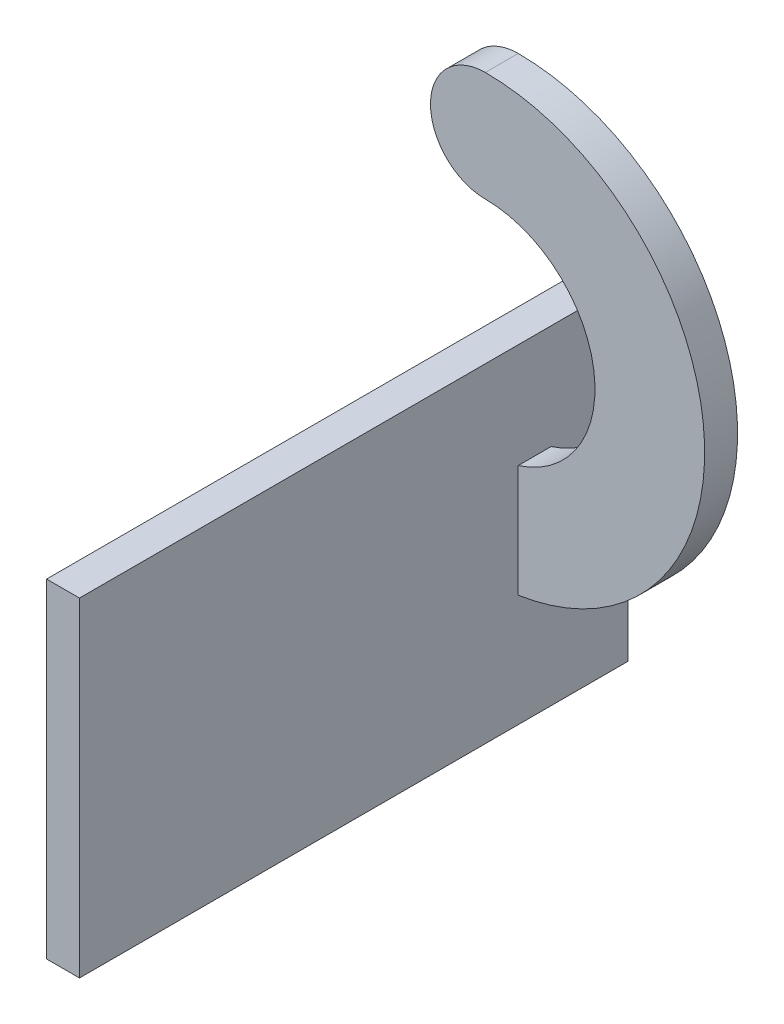
ISO-10303-21;
HEADER;
FILE_DESCRIPTION(('STEP AP214'),'2;1');
FILE_NAME('part.step','',(''),(''),'','','');
FILE_SCHEMA(('AUTOMOTIVE_DESIGN { 1 0 10303 214 1 1 1 1 }'));
ENDSEC;
DATA;
#1=APPLICATION_CONTEXT('core data for automotive mechanical design processes');
#2=APPLICATION_PROTOCOL_DEFINITION('international standard','automotive_design',2000,#1);
#3=PRODUCT_CONTEXT('',#1,'mechanical');
#4=PRODUCT('Part','Part','',(#3));
#5=PRODUCT_RELATED_PRODUCT_CATEGORY('part','',(#4));
#6=PRODUCT_DEFINITION_FORMATION('','',#4);
#7=PRODUCT_DEFINITION_CONTEXT('part definition',#1,'design');
#8=PRODUCT_DEFINITION('design','',#6,#7);
#9=PRODUCT_DEFINITION_SHAPE('','',#8);
#10=(LENGTH_UNIT() NAMED_UNIT(*) SI_UNIT(.MILLI.,.METRE.));
#11=(NAMED_UNIT(*) PLANE_ANGLE_UNIT() SI_UNIT($,.RADIAN.));
#12=(NAMED_UNIT(*) SI_UNIT($,.STERADIAN.) SOLID_ANGLE_UNIT());
#13=UNCERTAINTY_MEASURE_WITH_UNIT(LENGTH_MEASURE(1.E-05),#10,'distance_accuracy_value','');
#14=(GEOMETRIC_REPRESENTATION_CONTEXT(3) GLOBAL_UNCERTAINTY_ASSIGNED_CONTEXT((#13)) GLOBAL_UNIT_ASSIGNED_CONTEXT((#10,
#11,#12)) REPRESENTATION_CONTEXT('',''));
#15=CARTESIAN_POINT('',(0.,0.,0.));
#16=DIRECTION('',(0.,0.,1.));
#17=DIRECTION('',(1.,0.,0.));
#18=AXIS2_PLACEMENT_3D('',#15,#16,#17);
#19=CARTESIAN_POINT('',(0.,0.,0.));
#20=DIRECTION('',(0.,0.,1.));
#21=DIRECTION('',(1.,0.,0.));
#22=AXIS2_PLACEMENT_3D('',#19,#20,#21);
#23=PLANE('',#22);
#24=DIRECTION('',(0.,-1.,0.));
#25=VECTOR('',#24,1.);
#26=CARTESIAN_POINT('',(3.,0.,0.));
#27=LINE('',#26,#25);
#28=CARTESIAN_POINT('',(3.,-9.53939201416946,0.));
#29=VERTEX_POINT('',#28);
#30=CARTESIAN_POINT('',(3.,-19.7737199332852,0.));
#31=VERTEX_POINT('',#30);
#32=EDGE_CURVE('E11',#29,#31,#27,.T.);
#33=ORIENTED_EDGE('',*,*,#32,.F.);
#34=CARTESIAN_POINT('',(0.,0.,0.));
#35=DIRECTION('',(0.,0.,1.));
#36=DIRECTION('',(1.,0.,0.));
#37=AXIS2_PLACEMENT_3D('',#34,#35,#36);
#38=CIRCLE('',#37,10.);
#39=CARTESIAN_POINT('',(0.,10.,0.));
#40=VERTEX_POINT('',#39);
#41=EDGE_CURVE('E185',#29,#40,#38,.T.);
#42=ORIENTED_EDGE('',*,*,#41,.T.);
#43=CARTESIAN_POINT('',(0.,15.,0.));
#44=DIRECTION('',(0.,0.,1.));
#45=DIRECTION('',(1.,0.,0.));
#46=AXIS2_PLACEMENT_3D('',#43,#44,#45);
#47=CIRCLE('',#46,5.);
#48=CARTESIAN_POINT('',(0.,20.,0.));
#49=VERTEX_POINT('',#48);
#50=EDGE_CURVE('E169',#49,#40,#47,.T.);
#51=ORIENTED_EDGE('',*,*,#50,.F.);
#52=CARTESIAN_POINT('',(0.,0.,0.));
#53=DIRECTION('',(0.,0.,1.));
#54=DIRECTION('',(1.,0.,0.));
#55=AXIS2_PLACEMENT_3D('',#52,#53,#54);
#56=CIRCLE('',#55,20.);
#57=EDGE_CURVE('E175',#31,#49,#56,.T.);
#58=ORIENTED_EDGE('',*,*,#57,.F.);
#59=EDGE_LOOP('',(#33,#42,#51,#58));
#60=FACE_BOUND('',#59,.T.);
#61=ADVANCED_FACE('F41',(#60),#23,.F.);
#62=CARTESIAN_POINT('',(0.,0.,3.));
#63=DIRECTION('',(0.,0.,-1.));
#64=DIRECTION('',(-1.,0.,0.));
#65=AXIS2_PLACEMENT_3D('',#62,#63,#64);
#66=CYLINDRICAL_SURFACE('',#65,20.);
#67=DIRECTION('',(0.,0.,-1.));
#68=VECTOR('',#67,1.);
#69=CARTESIAN_POINT('',(3.,-19.7737199332852,3.));
#70=LINE('',#69,#68);
#71=CARTESIAN_POINT('',(3.,-19.7737199332852,3.));
#72=VERTEX_POINT('',#71);
#73=EDGE_CURVE('E65',#31,#72,#70,.F.);
#74=ORIENTED_EDGE('',*,*,#73,.F.);
#75=ORIENTED_EDGE('',*,*,#57,.T.);
#76=DIRECTION('',(0.,0.,-1.));
#77=VECTOR('',#76,1.);
#78=CARTESIAN_POINT('',(0.,20.,3.));
#79=LINE('',#78,#77);
#80=CARTESIAN_POINT('',(0.,20.,3.));
#81=VERTEX_POINT('',#80);
#82=EDGE_CURVE('E181',#81,#49,#79,.T.);
#83=ORIENTED_EDGE('',*,*,#82,.F.);
#84=CARTESIAN_POINT('',(0.,0.,3.));
#85=DIRECTION('',(0.,0.,1.));
#86=DIRECTION('',(1.,0.,0.));
#87=AXIS2_PLACEMENT_3D('',#84,#85,#86);
#88=CIRCLE('',#87,20.);
#89=EDGE_CURVE('E178',#72,#81,#88,.T.);
#90=ORIENTED_EDGE('',*,*,#89,.F.);
#91=EDGE_LOOP('',(#74,#75,#83,#90));
#92=FACE_BOUND('',#91,.T.);
#93=ADVANCED_FACE('F208',(#92),#66,.T.);
#94=CARTESIAN_POINT('',(0.,15.,3.));
#95=DIRECTION('',(0.,0.,-1.));
#96=DIRECTION('',(-1.,0.,0.));
#97=AXIS2_PLACEMENT_3D('',#94,#95,#96);
#98=CYLINDRICAL_SURFACE('',#97,5.);
#99=ORIENTED_EDGE('',*,*,#50,.T.);
#100=DIRECTION('',(0.,0.,-1.));
#101=VECTOR('',#100,1.);
#102=CARTESIAN_POINT('',(0.,10.,3.));
#103=LINE('',#102,#101);
#104=CARTESIAN_POINT('',(0.,10.,3.));
#105=VERTEX_POINT('',#104);
#106=EDGE_CURVE('E45',#105,#40,#103,.T.);
#107=ORIENTED_EDGE('',*,*,#106,.F.);
#108=CARTESIAN_POINT('',(0.,15.,3.));
#109=DIRECTION('',(0.,0.,1.));
#110=DIRECTION('',(1.,0.,0.));
#111=AXIS2_PLACEMENT_3D('',#108,#109,#110);
#112=CIRCLE('',#111,5.);
#113=EDGE_CURVE('E170',#81,#105,#112,.T.);
#114=ORIENTED_EDGE('',*,*,#113,.F.);
#115=ORIENTED_EDGE('',*,*,#82,.T.);
#116=EDGE_LOOP('',(#99,#107,#114,#115));
#117=FACE_BOUND('',#116,.T.);
#118=ADVANCED_FACE('F43',(#117),#98,.T.);
#119=CARTESIAN_POINT('',(0.,0.,3.));
#120=DIRECTION('',(0.,0.,-1.));
#121=DIRECTION('',(-1.,0.,0.));
#122=AXIS2_PLACEMENT_3D('',#119,#120,#121);
#123=CYLINDRICAL_SURFACE('',#122,10.);
#124=DIRECTION('',(0.,0.,-1.));
#125=VECTOR('',#124,1.);
#126=CARTESIAN_POINT('',(3.,-9.53939201416946,3.));
#127=LINE('',#126,#125);
#128=CARTESIAN_POINT('',(3.,-9.53939201416946,3.));
#129=VERTEX_POINT('',#128);
#130=EDGE_CURVE('E164',#129,#29,#127,.T.);
#131=ORIENTED_EDGE('',*,*,#130,.F.);
#132=CARTESIAN_POINT('',(0.,0.,3.));
#133=DIRECTION('',(0.,0.,1.));
#134=DIRECTION('',(1.,0.,0.));
#135=AXIS2_PLACEMENT_3D('',#132,#133,#134);
#136=CIRCLE('',#135,10.);
#137=EDGE_CURVE('E174',#129,#105,#136,.T.);
#138=ORIENTED_EDGE('',*,*,#137,.T.);
#139=ORIENTED_EDGE('',*,*,#106,.T.);
#140=ORIENTED_EDGE('',*,*,#41,.F.);
#141=EDGE_LOOP('',(#131,#138,#139,#140));
#142=FACE_BOUND('',#141,.T.);
#143=ADVANCED_FACE('F201',(#142),#123,.F.);
#144=CARTESIAN_POINT('',(0.,0.,3.));
#145=DIRECTION('',(1.,0.,0.));
#146=DIRECTION('',(0.,0.,-1.));
#147=AXIS2_PLACEMENT_3D('',#144,#145,#146);
#148=PLANE('',#147);
#149=DIRECTION('',(0.,0.,-1.));
#150=VECTOR('',#149,1.);
#151=CARTESIAN_POINT('',(0.,0.,0.));
#152=LINE('',#151,#150);
#153=CARTESIAN_POINT('',(0.,0.,43.));
#154=VERTEX_POINT('',#153);
#155=CARTESIAN_POINT('',(0.,0.,-7.));
#156=VERTEX_POINT('',#155);
#157=EDGE_CURVE('E108',#154,#156,#152,.T.);
#158=ORIENTED_EDGE('',*,*,#157,.T.);
#159=DIRECTION('',(0.,1.,0.));
#160=VECTOR('',#159,1.);
#161=CARTESIAN_POINT('',(0.,0.,-7.));
#162=LINE('',#161,#160);
#163=CARTESIAN_POINT('',(0.,-30.,-7.));
#164=VERTEX_POINT('',#163);
#165=EDGE_CURVE('E112',#164,#156,#162,.T.);
#166=ORIENTED_EDGE('',*,*,#165,.F.);
#167=DIRECTION('',(0.,0.,-1.));
#168=VECTOR('',#167,1.);
#169=CARTESIAN_POINT('',(0.,-30.,0.));
#170=LINE('',#169,#168);
#171=CARTESIAN_POINT('',(0.,-30.,43.));
#172=VERTEX_POINT('',#171);
#173=EDGE_CURVE('E155',#172,#164,#170,.T.);
#174=ORIENTED_EDGE('',*,*,#173,.F.);
#175=DIRECTION('',(0.,-1.,0.));
#176=VECTOR('',#175,1.);
#177=CARTESIAN_POINT('',(0.,0.,43.));
#178=LINE('',#177,#176);
#179=EDGE_CURVE('E114',#154,#172,#178,.T.);
#180=ORIENTED_EDGE('',*,*,#179,.F.);
#181=EDGE_LOOP('',(#158,#166,#174,#180));
#182=FACE_BOUND('',#181,.T.);
#183=ADVANCED_FACE('F110',(#182),#148,.F.);
#184=CARTESIAN_POINT('',(0.,0.,3.));
#185=DIRECTION('',(0.,0.,1.));
#186=DIRECTION('',(1.,0.,0.));
#187=AXIS2_PLACEMENT_3D('',#184,#185,#186);
#188=PLANE('',#187);
#189=DIRECTION('',(0.,1.,0.));
#190=VECTOR('',#189,1.);
#191=CARTESIAN_POINT('',(3.,0.,3.));
#192=LINE('',#191,#190);
#193=EDGE_CURVE('E51',#72,#129,#192,.T.);
#194=ORIENTED_EDGE('',*,*,#193,.F.);
#195=ORIENTED_EDGE('',*,*,#89,.T.);
#196=ORIENTED_EDGE('',*,*,#113,.T.);
#197=ORIENTED_EDGE('',*,*,#137,.F.);
#198=EDGE_LOOP('',(#194,#195,#196,#197));
#199=FACE_BOUND('',#198,.T.);
#200=ADVANCED_FACE('F207',(#199),#188,.T.);
#201=CARTESIAN_POINT('',(3.,0.,0.));
#202=DIRECTION('',(-1.,0.,0.));
#203=DIRECTION('',(0.,0.,1.));
#204=AXIS2_PLACEMENT_3D('',#201,#202,#203);
#205=PLANE('',#204);
#206=ORIENTED_EDGE('',*,*,#130,.T.);
#207=ORIENTED_EDGE('',*,*,#32,.T.);
#208=ORIENTED_EDGE('',*,*,#73,.T.);
#209=ORIENTED_EDGE('',*,*,#193,.T.);
#210=EDGE_LOOP('',(#206,#207,#208,#209));
#211=FACE_BOUND('',#210,.T.);
#212=DIRECTION('',(0.,0.,1.));
#213=VECTOR('',#212,1.);
#214=CARTESIAN_POINT('',(3.,-30.,0.));
#215=LINE('',#214,#213);
#216=CARTESIAN_POINT('',(3.,-30.,-7.));
#217=VERTEX_POINT('',#216);
#218=CARTESIAN_POINT('',(3.,-30.,43.));
#219=VERTEX_POINT('',#218);
#220=EDGE_CURVE('E120',#217,#219,#215,.T.);
#221=ORIENTED_EDGE('',*,*,#220,.F.);
#222=DIRECTION('',(0.,-1.,0.));
#223=VECTOR('',#222,1.);
#224=CARTESIAN_POINT('',(3.,0.,-7.));
#225=LINE('',#224,#223);
#226=CARTESIAN_POINT('',(3.,0.,-7.));
#227=VERTEX_POINT('',#226);
#228=EDGE_CURVE('E129',#227,#217,#225,.T.);
#229=ORIENTED_EDGE('',*,*,#228,.F.);
#230=DIRECTION('',(0.,0.,1.));
#231=VECTOR('',#230,1.);
#232=CARTESIAN_POINT('',(3.,0.,0.));
#233=LINE('',#232,#231);
#234=CARTESIAN_POINT('',(3.,0.,43.));
#235=VERTEX_POINT('',#234);
#236=EDGE_CURVE('E119',#227,#235,#233,.T.);
#237=ORIENTED_EDGE('',*,*,#236,.T.);
#238=DIRECTION('',(0.,1.,0.));
#239=VECTOR('',#238,1.);
#240=CARTESIAN_POINT('',(3.,0.,43.));
#241=LINE('',#240,#239);
#242=EDGE_CURVE('E148',#219,#235,#241,.T.);
#243=ORIENTED_EDGE('',*,*,#242,.F.);
#244=EDGE_LOOP('',(#221,#229,#237,#243));
#245=FACE_BOUND('',#244,.T.);
#246=ADVANCED_FACE('F204',(#211,#245),#205,.F.);
#247=CARTESIAN_POINT('',(0.,0.,0.));
#248=DIRECTION('',(0.,1.,0.));
#249=DIRECTION('',(0.,0.,1.));
#250=AXIS2_PLACEMENT_3D('',#247,#248,#249);
#251=PLANE('',#250);
#252=ORIENTED_EDGE('',*,*,#157,.F.);
#253=DIRECTION('',(-1.,0.,0.));
#254=VECTOR('',#253,1.);
#255=CARTESIAN_POINT('',(0.,0.,43.));
#256=LINE('',#255,#254);
#257=EDGE_CURVE('E152',#235,#154,#256,.T.);
#258=ORIENTED_EDGE('',*,*,#257,.F.);
#259=ORIENTED_EDGE('',*,*,#236,.F.);
#260=DIRECTION('',(1.,0.,0.));
#261=VECTOR('',#260,1.);
#262=CARTESIAN_POINT('',(0.,0.,-7.));
#263=LINE('',#262,#261);
#264=EDGE_CURVE('E123',#156,#227,#263,.T.);
#265=ORIENTED_EDGE('',*,*,#264,.F.);
#266=EDGE_LOOP('',(#252,#258,#259,#265));
#267=FACE_BOUND('',#266,.T.);
#268=ADVANCED_FACE('F124',(#267),#251,.T.);
#269=CARTESIAN_POINT('',(0.,-30.,0.));
#270=DIRECTION('',(0.,1.,0.));
#271=DIRECTION('',(0.,0.,1.));
#272=AXIS2_PLACEMENT_3D('',#269,#270,#271);
#273=PLANE('',#272);
#274=ORIENTED_EDGE('',*,*,#173,.T.);
#275=DIRECTION('',(-1.,0.,0.));
#276=VECTOR('',#275,1.);
#277=CARTESIAN_POINT('',(0.,-30.,-7.));
#278=LINE('',#277,#276);
#279=EDGE_CURVE('E134',#217,#164,#278,.T.);
#280=ORIENTED_EDGE('',*,*,#279,.F.);
#281=ORIENTED_EDGE('',*,*,#220,.T.);
#282=DIRECTION('',(1.,0.,0.));
#283=VECTOR('',#282,1.);
#284=CARTESIAN_POINT('',(0.,-30.,43.));
#285=LINE('',#284,#283);
#286=EDGE_CURVE('E144',#172,#219,#285,.T.);
#287=ORIENTED_EDGE('',*,*,#286,.F.);
#288=EDGE_LOOP('',(#274,#280,#281,#287));
#289=FACE_BOUND('',#288,.T.);
#290=ADVANCED_FACE('F246',(#289),#273,.F.);
#291=CARTESIAN_POINT('',(0.,0.,43.));
#292=DIRECTION('',(0.,0.,1.));
#293=DIRECTION('',(1.,0.,0.));
#294=AXIS2_PLACEMENT_3D('',#291,#292,#293);
#295=PLANE('',#294);
#296=ORIENTED_EDGE('',*,*,#179,.T.);
#297=ORIENTED_EDGE('',*,*,#286,.T.);
#298=ORIENTED_EDGE('',*,*,#242,.T.);
#299=ORIENTED_EDGE('',*,*,#257,.T.);
#300=EDGE_LOOP('',(#296,#297,#298,#299));
#301=FACE_BOUND('',#300,.T.);
#302=ADVANCED_FACE('F253',(#301),#295,.T.);
#303=CARTESIAN_POINT('',(0.,0.,-7.));
#304=DIRECTION('',(0.,0.,1.));
#305=DIRECTION('',(1.,0.,0.));
#306=AXIS2_PLACEMENT_3D('',#303,#304,#305);
#307=PLANE('',#306);
#308=ORIENTED_EDGE('',*,*,#165,.T.);
#309=ORIENTED_EDGE('',*,*,#264,.T.);
#310=ORIENTED_EDGE('',*,*,#228,.T.);
#311=ORIENTED_EDGE('',*,*,#279,.T.);
#312=EDGE_LOOP('',(#308,#309,#310,#311));
#313=FACE_BOUND('',#312,.T.);
#314=ADVANCED_FACE('F132',(#313),#307,.F.);
#315=CLOSED_SHELL('',(#61,#93,#118,#143,#183,#200,#246,#268,#290,#302,#314));
#316=MANIFOLD_SOLID_BREP('B2',#315);
#317=ADVANCED_BREP_SHAPE_REPRESENTATION('',(#18,#316),#14);
#318=SHAPE_DEFINITION_REPRESENTATION(#9,#317);
ENDSEC;
END-ISO-10303-21;
